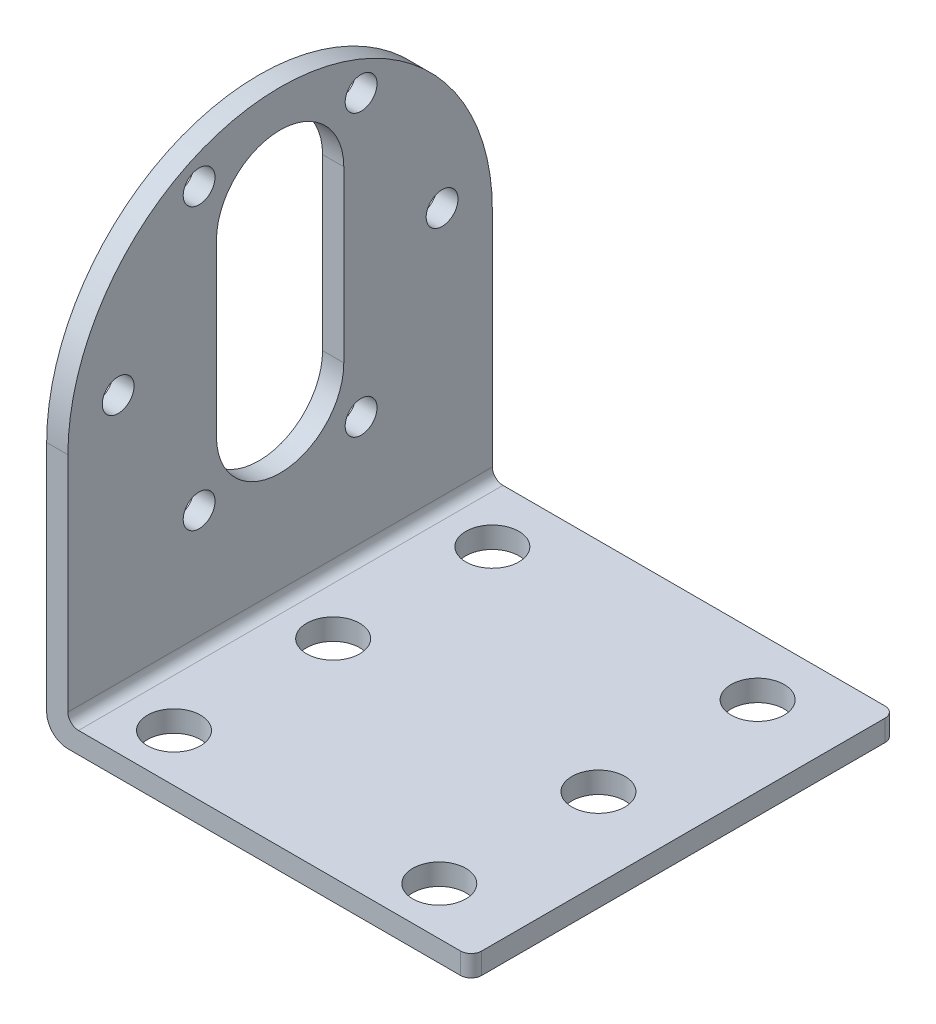
ISO-10303-21;
HEADER;
FILE_DESCRIPTION(('STEP AP214'),'2;1');
FILE_NAME('part.step','',(''),(''),'','','');
FILE_SCHEMA(('AUTOMOTIVE_DESIGN { 1 0 10303 214 1 1 1 1 }'));
ENDSEC;
DATA;
#1=APPLICATION_CONTEXT('core data for automotive mechanical design processes');
#2=APPLICATION_PROTOCOL_DEFINITION('international standard','automotive_design',2000,#1);
#3=PRODUCT_CONTEXT('',#1,'mechanical');
#4=PRODUCT('Part','Part','',(#3));
#5=PRODUCT_RELATED_PRODUCT_CATEGORY('part','',(#4));
#6=PRODUCT_DEFINITION_FORMATION('','',#4);
#7=PRODUCT_DEFINITION_CONTEXT('part definition',#1,'design');
#8=PRODUCT_DEFINITION('design','',#6,#7);
#9=PRODUCT_DEFINITION_SHAPE('','',#8);
#10=(LENGTH_UNIT() NAMED_UNIT(*) SI_UNIT(.MILLI.,.METRE.));
#11=(NAMED_UNIT(*) PLANE_ANGLE_UNIT() SI_UNIT($,.RADIAN.));
#12=(NAMED_UNIT(*) SI_UNIT($,.STERADIAN.) SOLID_ANGLE_UNIT());
#13=UNCERTAINTY_MEASURE_WITH_UNIT(LENGTH_MEASURE(1.E-05),#10,'distance_accuracy_value','');
#14=(GEOMETRIC_REPRESENTATION_CONTEXT(3) GLOBAL_UNCERTAINTY_ASSIGNED_CONTEXT((#13)) GLOBAL_UNIT_ASSIGNED_CONTEXT((#10,
#11,#12)) REPRESENTATION_CONTEXT('',''));
#15=CARTESIAN_POINT('',(0.,0.,0.));
#16=DIRECTION('',(0.,0.,1.));
#17=DIRECTION('',(1.,0.,0.));
#18=AXIS2_PLACEMENT_3D('',#15,#16,#17);
#19=CARTESIAN_POINT('',(2.,3.,40.));
#20=DIRECTION('',(-1.,0.,0.));
#21=DIRECTION('',(0.,0.,1.));
#22=AXIS2_PLACEMENT_3D('',#19,#20,#21);
#23=PLANE('',#22);
#24=CARTESIAN_POINT('',(2.,26.5,4.735));
#25=DIRECTION('',(1.,0.,0.));
#26=DIRECTION('',(0.,0.,-1.));
#27=AXIS2_PLACEMENT_3D('',#24,#25,#26);
#28=CIRCLE('',#27,1.5);
#29=CARTESIAN_POINT('',(2.,26.5,3.235));
#30=VERTEX_POINT('',#29);
#31=EDGE_CURVE('E274',#30,#30,#28,.T.);
#32=ORIENTED_EDGE('',*,*,#31,.F.);
#33=EDGE_LOOP('',(#32));
#34=FACE_BOUND('',#33,.T.);
#35=CARTESIAN_POINT('',(2.,39.7198777887694,12.3674999999999));
#36=DIRECTION('',(1.,0.,0.));
#37=DIRECTION('',(0.,0.,-1.));
#38=AXIS2_PLACEMENT_3D('',#35,#36,#37);
#39=CIRCLE('',#38,1.5);
#40=CARTESIAN_POINT('',(2.,39.7198777887694,10.8674999999999));
#41=VERTEX_POINT('',#40);
#42=EDGE_CURVE('E305',#41,#41,#39,.T.);
#43=ORIENTED_EDGE('',*,*,#42,.F.);
#44=EDGE_LOOP('',(#43));
#45=FACE_BOUND('',#44,.T.);
#46=CARTESIAN_POINT('',(2.,26.5,35.265));
#47=DIRECTION('',(1.,0.,0.));
#48=DIRECTION('',(0.,0.,-1.));
#49=AXIS2_PLACEMENT_3D('',#46,#47,#48);
#50=CIRCLE('',#49,1.5);
#51=CARTESIAN_POINT('',(2.,26.5,33.765));
#52=VERTEX_POINT('',#51);
#53=EDGE_CURVE('E316',#52,#52,#50,.T.);
#54=ORIENTED_EDGE('',*,*,#53,.F.);
#55=EDGE_LOOP('',(#54));
#56=FACE_BOUND('',#55,.T.);
#57=CARTESIAN_POINT('',(2.,13.2801222112306,27.6325000000001));
#58=DIRECTION('',(1.,0.,0.));
#59=DIRECTION('',(0.,0.,-1.));
#60=AXIS2_PLACEMENT_3D('',#57,#58,#59);
#61=CIRCLE('',#60,1.5);
#62=CARTESIAN_POINT('',(2.,13.2801222112306,26.1325000000001));
#63=VERTEX_POINT('',#62);
#64=EDGE_CURVE('E323',#63,#63,#61,.T.);
#65=ORIENTED_EDGE('',*,*,#64,.F.);
#66=EDGE_LOOP('',(#65));
#67=FACE_BOUND('',#66,.T.);
#68=CARTESIAN_POINT('',(2.,13.2801222112306,12.3674999999999));
#69=DIRECTION('',(1.,0.,0.));
#70=DIRECTION('',(0.,0.,-1.));
#71=AXIS2_PLACEMENT_3D('',#68,#69,#70);
#72=CIRCLE('',#71,1.5);
#73=CARTESIAN_POINT('',(2.,13.2801222112306,10.8674999999999));
#74=VERTEX_POINT('',#73);
#75=EDGE_CURVE('E320',#74,#74,#72,.T.);
#76=ORIENTED_EDGE('',*,*,#75,.F.);
#77=EDGE_LOOP('',(#76));
#78=FACE_BOUND('',#77,.T.);
#79=CARTESIAN_POINT('',(2.,39.7198777887694,27.6325000000001));
#80=DIRECTION('',(1.,0.,0.));
#81=DIRECTION('',(0.,0.,-1.));
#82=AXIS2_PLACEMENT_3D('',#79,#80,#81);
#83=CIRCLE('',#82,1.5);
#84=CARTESIAN_POINT('',(2.,39.7198777887694,26.1325000000001));
#85=VERTEX_POINT('',#84);
#86=EDGE_CURVE('E319',#85,#85,#83,.T.);
#87=ORIENTED_EDGE('',*,*,#86,.F.);
#88=EDGE_LOOP('',(#87));
#89=FACE_BOUND('',#88,.T.);
#90=DIRECTION('',(0.,-1.,0.));
#91=VECTOR('',#90,1.);
#92=CARTESIAN_POINT('',(2.,34.5,26.));
#93=LINE('',#92,#91);
#94=CARTESIAN_POINT('',(2.,34.5,26.));
#95=VERTEX_POINT('',#94);
#96=CARTESIAN_POINT('',(2.,18.5,26.));
#97=VERTEX_POINT('',#96);
#98=EDGE_CURVE('E165',#95,#97,#93,.T.);
#99=ORIENTED_EDGE('',*,*,#98,.F.);
#100=CARTESIAN_POINT('',(2.,34.5,20.));
#101=DIRECTION('',(1.,0.,0.));
#102=DIRECTION('',(0.,0.,-1.));
#103=AXIS2_PLACEMENT_3D('',#100,#101,#102);
#104=CIRCLE('',#103,5.99999999999999);
#105=CARTESIAN_POINT('',(2.,34.5,14.));
#106=VERTEX_POINT('',#105);
#107=EDGE_CURVE('E170',#106,#95,#104,.T.);
#108=ORIENTED_EDGE('',*,*,#107,.F.);
#109=DIRECTION('',(0.,1.,0.));
#110=VECTOR('',#109,1.);
#111=CARTESIAN_POINT('',(2.,34.5,14.));
#112=LINE('',#111,#110);
#113=CARTESIAN_POINT('',(2.,18.5,14.));
#114=VERTEX_POINT('',#113);
#115=EDGE_CURVE('E174',#114,#106,#112,.T.);
#116=ORIENTED_EDGE('',*,*,#115,.F.);
#117=CARTESIAN_POINT('',(2.,18.5,20.));
#118=DIRECTION('',(1.,0.,0.));
#119=DIRECTION('',(0.,0.,-1.));
#120=AXIS2_PLACEMENT_3D('',#117,#118,#119);
#121=CIRCLE('',#120,5.99999999999999);
#122=EDGE_CURVE('E154',#97,#114,#121,.T.);
#123=ORIENTED_EDGE('',*,*,#122,.F.);
#124=EDGE_LOOP('',(#99,#108,#116,#123));
#125=FACE_BOUND('',#124,.T.);
#126=DIRECTION('',(0.,1.,0.));
#127=VECTOR('',#126,1.);
#128=CARTESIAN_POINT('',(2.,3.,0.));
#129=LINE('',#128,#127);
#130=CARTESIAN_POINT('',(2.,3.,0.));
#131=VERTEX_POINT('',#130);
#132=CARTESIAN_POINT('',(2.,24.,0.));
#133=VERTEX_POINT('',#132);
#134=EDGE_CURVE('E233',#131,#133,#129,.T.);
#135=ORIENTED_EDGE('',*,*,#134,.T.);
#136=CARTESIAN_POINT('',(2.,24.,20.));
#137=DIRECTION('',(1.,0.,0.));
#138=DIRECTION('',(0.,0.,-1.));
#139=AXIS2_PLACEMENT_3D('',#136,#137,#138);
#140=CIRCLE('',#139,20.);
#141=CARTESIAN_POINT('',(2.,24.,40.));
#142=VERTEX_POINT('',#141);
#143=EDGE_CURVE('E181',#142,#133,#140,.F.);
#144=ORIENTED_EDGE('',*,*,#143,.F.);
#145=DIRECTION('',(0.,1.,0.));
#146=VECTOR('',#145,1.);
#147=CARTESIAN_POINT('',(2.,3.,40.));
#148=LINE('',#147,#146);
#149=CARTESIAN_POINT('',(2.,3.,40.));
#150=VERTEX_POINT('',#149);
#151=EDGE_CURVE('E220',#150,#142,#148,.T.);
#152=ORIENTED_EDGE('',*,*,#151,.F.);
#153=DIRECTION('',(0.,0.,-1.));
#154=VECTOR('',#153,1.);
#155=CARTESIAN_POINT('',(2.,3.,40.));
#156=LINE('',#155,#154);
#157=EDGE_CURVE('E249',#150,#131,#156,.T.);
#158=ORIENTED_EDGE('',*,*,#157,.T.);
#159=EDGE_LOOP('',(#135,#144,#152,#158));
#160=FACE_BOUND('',#159,.T.);
#161=ADVANCED_FACE('F42',(#34,#45,#56,#67,#78,#89,#125,#160),#23,.F.);
#162=CARTESIAN_POINT('',(0.,2.00000000000001,40.));
#163=DIRECTION('',(1.,0.,0.));
#164=DIRECTION('',(0.,0.,-1.));
#165=AXIS2_PLACEMENT_3D('',#162,#163,#164);
#166=PLANE('',#165);
#167=CARTESIAN_POINT('',(0.,26.5,4.735));
#168=DIRECTION('',(1.,0.,0.));
#169=DIRECTION('',(0.,0.,-1.));
#170=AXIS2_PLACEMENT_3D('',#167,#168,#169);
#171=CIRCLE('',#170,1.5);
#172=CARTESIAN_POINT('',(0.,26.5,3.235));
#173=VERTEX_POINT('',#172);
#174=EDGE_CURVE('E286',#173,#173,#171,.T.);
#175=ORIENTED_EDGE('',*,*,#174,.T.);
#176=EDGE_LOOP('',(#175));
#177=FACE_BOUND('',#176,.T.);
#178=CARTESIAN_POINT('',(0.,39.7198777887694,12.3674999999999));
#179=DIRECTION('',(1.,0.,0.));
#180=DIRECTION('',(0.,0.,-1.));
#181=AXIS2_PLACEMENT_3D('',#178,#179,#180);
#182=CIRCLE('',#181,1.5);
#183=CARTESIAN_POINT('',(0.,39.7198777887694,10.8674999999999));
#184=VERTEX_POINT('',#183);
#185=EDGE_CURVE('E283',#184,#184,#182,.T.);
#186=ORIENTED_EDGE('',*,*,#185,.T.);
#187=EDGE_LOOP('',(#186));
#188=FACE_BOUND('',#187,.T.);
#189=CARTESIAN_POINT('',(0.,26.5,35.265));
#190=DIRECTION('',(1.,0.,0.));
#191=DIRECTION('',(0.,0.,-1.));
#192=AXIS2_PLACEMENT_3D('',#189,#190,#191);
#193=CIRCLE('',#192,1.5);
#194=CARTESIAN_POINT('',(0.,26.5,33.765));
#195=VERTEX_POINT('',#194);
#196=EDGE_CURVE('E280',#195,#195,#193,.T.);
#197=ORIENTED_EDGE('',*,*,#196,.T.);
#198=EDGE_LOOP('',(#197));
#199=FACE_BOUND('',#198,.T.);
#200=CARTESIAN_POINT('',(0.,13.2801222112306,27.6325000000001));
#201=DIRECTION('',(1.,0.,0.));
#202=DIRECTION('',(0.,0.,-1.));
#203=AXIS2_PLACEMENT_3D('',#200,#201,#202);
#204=CIRCLE('',#203,1.5);
#205=CARTESIAN_POINT('',(0.,13.2801222112306,26.1325000000001));
#206=VERTEX_POINT('',#205);
#207=EDGE_CURVE('E277',#206,#206,#204,.T.);
#208=ORIENTED_EDGE('',*,*,#207,.T.);
#209=EDGE_LOOP('',(#208));
#210=FACE_BOUND('',#209,.T.);
#211=CARTESIAN_POINT('',(0.,13.2801222112306,12.3674999999999));
#212=DIRECTION('',(1.,0.,0.));
#213=DIRECTION('',(0.,0.,-1.));
#214=AXIS2_PLACEMENT_3D('',#211,#212,#213);
#215=CIRCLE('',#214,1.5);
#216=CARTESIAN_POINT('',(0.,13.2801222112306,10.8674999999999));
#217=VERTEX_POINT('',#216);
#218=EDGE_CURVE('E273',#217,#217,#215,.T.);
#219=ORIENTED_EDGE('',*,*,#218,.T.);
#220=EDGE_LOOP('',(#219));
#221=FACE_BOUND('',#220,.T.);
#222=CARTESIAN_POINT('',(0.,39.7198777887694,27.6325000000001));
#223=DIRECTION('',(1.,0.,0.));
#224=DIRECTION('',(0.,0.,-1.));
#225=AXIS2_PLACEMENT_3D('',#222,#223,#224);
#226=CIRCLE('',#225,1.5);
#227=CARTESIAN_POINT('',(0.,39.7198777887694,26.1325000000001));
#228=VERTEX_POINT('',#227);
#229=EDGE_CURVE('E270',#228,#228,#226,.T.);
#230=ORIENTED_EDGE('',*,*,#229,.T.);
#231=EDGE_LOOP('',(#230));
#232=FACE_BOUND('',#231,.T.);
#233=DIRECTION('',(0.,1.,0.));
#234=VECTOR('',#233,1.);
#235=CARTESIAN_POINT('',(0.,2.00000000000002,14.));
#236=LINE('',#235,#234);
#237=CARTESIAN_POINT('',(0.,18.5,14.));
#238=VERTEX_POINT('',#237);
#239=CARTESIAN_POINT('',(0.,34.5,14.));
#240=VERTEX_POINT('',#239);
#241=EDGE_CURVE('E263',#238,#240,#236,.T.);
#242=ORIENTED_EDGE('',*,*,#241,.T.);
#243=CARTESIAN_POINT('',(0.,34.5,20.));
#244=DIRECTION('',(1.,0.,0.));
#245=DIRECTION('',(0.,0.,-1.));
#246=AXIS2_PLACEMENT_3D('',#243,#244,#245);
#247=CIRCLE('',#246,5.99999999999999);
#248=CARTESIAN_POINT('',(0.,34.5,26.));
#249=VERTEX_POINT('',#248);
#250=EDGE_CURVE('E266',#240,#249,#247,.T.);
#251=ORIENTED_EDGE('',*,*,#250,.T.);
#252=DIRECTION('',(0.,-1.,0.));
#253=VECTOR('',#252,1.);
#254=CARTESIAN_POINT('',(0.,2.00000000000002,26.));
#255=LINE('',#254,#253);
#256=CARTESIAN_POINT('',(0.,18.5,26.));
#257=VERTEX_POINT('',#256);
#258=EDGE_CURVE('E260',#249,#257,#255,.T.);
#259=ORIENTED_EDGE('',*,*,#258,.T.);
#260=CARTESIAN_POINT('',(0.,18.5,20.));
#261=DIRECTION('',(1.,0.,0.));
#262=DIRECTION('',(0.,0.,-1.));
#263=AXIS2_PLACEMENT_3D('',#260,#261,#262);
#264=CIRCLE('',#263,5.99999999999999);
#265=EDGE_CURVE('E157',#257,#238,#264,.T.);
#266=ORIENTED_EDGE('',*,*,#265,.T.);
#267=EDGE_LOOP('',(#242,#251,#259,#266));
#268=FACE_BOUND('',#267,.T.);
#269=DIRECTION('',(0.,-1.,0.));
#270=VECTOR('',#269,1.);
#271=CARTESIAN_POINT('',(0.,2.00000000000001,40.));
#272=LINE('',#271,#270);
#273=CARTESIAN_POINT('',(0.,24.,40.));
#274=VERTEX_POINT('',#273);
#275=CARTESIAN_POINT('',(0.,2.,40.));
#276=VERTEX_POINT('',#275);
#277=EDGE_CURVE('E223',#274,#276,#272,.T.);
#278=ORIENTED_EDGE('',*,*,#277,.F.);
#279=CARTESIAN_POINT('',(0.,24.,20.));
#280=DIRECTION('',(1.,0.,0.));
#281=DIRECTION('',(0.,0.,-1.));
#282=AXIS2_PLACEMENT_3D('',#279,#280,#281);
#283=CIRCLE('',#282,20.);
#284=CARTESIAN_POINT('',(0.,24.,0.));
#285=VERTEX_POINT('',#284);
#286=EDGE_CURVE('E187',#274,#285,#283,.F.);
#287=ORIENTED_EDGE('',*,*,#286,.T.);
#288=DIRECTION('',(0.,-1.,0.));
#289=VECTOR('',#288,1.);
#290=CARTESIAN_POINT('',(0.,2.00000000000001,0.));
#291=LINE('',#290,#289);
#292=CARTESIAN_POINT('',(0.,2.,0.));
#293=VERTEX_POINT('',#292);
#294=EDGE_CURVE('E236',#285,#293,#291,.T.);
#295=ORIENTED_EDGE('',*,*,#294,.T.);
#296=DIRECTION('',(0.,0.,-1.));
#297=VECTOR('',#296,1.);
#298=CARTESIAN_POINT('',(0.,2.,40.));
#299=LINE('',#298,#297);
#300=EDGE_CURVE('E246',#276,#293,#299,.T.);
#301=ORIENTED_EDGE('',*,*,#300,.F.);
#302=EDGE_LOOP('',(#278,#287,#295,#301));
#303=FACE_BOUND('',#302,.T.);
#304=ADVANCED_FACE('F335',(#177,#188,#199,#210,#221,#232,#268,#303),#166,.F.);
#305=CARTESIAN_POINT('',(3.,2.,40.));
#306=DIRECTION('',(0.,-1.,0.));
#307=DIRECTION('',(0.,0.,-1.));
#308=AXIS2_PLACEMENT_3D('',#305,#306,#307);
#309=PLANE('',#308);
#310=CARTESIAN_POINT('',(7.5,2.,20.5));
#311=DIRECTION('',(0.,1.,0.));
#312=DIRECTION('',(0.,0.,1.));
#313=AXIS2_PLACEMENT_3D('',#310,#311,#312);
#314=CIRCLE('',#313,2.5);
#315=CARTESIAN_POINT('',(7.5,2.,23.));
#316=VERTEX_POINT('',#315);
#317=EDGE_CURVE('E301',#316,#316,#314,.T.);
#318=ORIENTED_EDGE('',*,*,#317,.F.);
#319=EDGE_LOOP('',(#318));
#320=FACE_BOUND('',#319,.T.);
#321=CARTESIAN_POINT('',(32.5,2.,20.5));
#322=DIRECTION('',(0.,1.,0.));
#323=DIRECTION('',(0.,0.,1.));
#324=AXIS2_PLACEMENT_3D('',#321,#322,#323);
#325=CIRCLE('',#324,2.5);
#326=CARTESIAN_POINT('',(32.5,2.,23.));
#327=VERTEX_POINT('',#326);
#328=EDGE_CURVE('E307',#327,#327,#325,.T.);
#329=ORIENTED_EDGE('',*,*,#328,.F.);
#330=EDGE_LOOP('',(#329));
#331=FACE_BOUND('',#330,.T.);
#332=CARTESIAN_POINT('',(32.5,2.,35.5));
#333=DIRECTION('',(0.,1.,0.));
#334=DIRECTION('',(0.,0.,1.));
#335=AXIS2_PLACEMENT_3D('',#332,#333,#334);
#336=CIRCLE('',#335,2.50000000000002);
#337=CARTESIAN_POINT('',(32.5,2.,38.));
#338=VERTEX_POINT('',#337);
#339=EDGE_CURVE('E190',#338,#338,#336,.T.);
#340=ORIENTED_EDGE('',*,*,#339,.F.);
#341=EDGE_LOOP('',(#340));
#342=FACE_BOUND('',#341,.T.);
#343=CARTESIAN_POINT('',(32.5,2.,5.5));
#344=DIRECTION('',(0.,1.,0.));
#345=DIRECTION('',(0.,0.,1.));
#346=AXIS2_PLACEMENT_3D('',#343,#344,#345);
#347=CIRCLE('',#346,2.50000000000002);
#348=CARTESIAN_POINT('',(32.5,2.,8.00000000000002));
#349=VERTEX_POINT('',#348);
#350=EDGE_CURVE('E196',#349,#349,#347,.T.);
#351=ORIENTED_EDGE('',*,*,#350,.F.);
#352=EDGE_LOOP('',(#351));
#353=FACE_BOUND('',#352,.T.);
#354=CARTESIAN_POINT('',(7.5,2.,5.5));
#355=DIRECTION('',(0.,1.,0.));
#356=DIRECTION('',(0.,0.,1.));
#357=AXIS2_PLACEMENT_3D('',#354,#355,#356);
#358=CIRCLE('',#357,2.50000000000001);
#359=CARTESIAN_POINT('',(7.5,2.,8.00000000000002));
#360=VERTEX_POINT('',#359);
#361=EDGE_CURVE('E202',#360,#360,#358,.T.);
#362=ORIENTED_EDGE('',*,*,#361,.F.);
#363=EDGE_LOOP('',(#362));
#364=FACE_BOUND('',#363,.T.);
#365=DIRECTION('',(0.,0.,-1.));
#366=VECTOR('',#365,1.);
#367=CARTESIAN_POINT('',(40.,2.,40.));
#368=LINE('',#367,#366);
#369=CARTESIAN_POINT('',(40.,2.,39.));
#370=VERTEX_POINT('',#369);
#371=CARTESIAN_POINT('',(40.,2.,1.));
#372=VERTEX_POINT('',#371);
#373=EDGE_CURVE('E255',#370,#372,#368,.T.);
#374=ORIENTED_EDGE('',*,*,#373,.T.);
#375=CARTESIAN_POINT('',(39.,2.,1.));
#376=DIRECTION('',(0.,-1.,0.));
#377=DIRECTION('',(0.,0.,-1.));
#378=AXIS2_PLACEMENT_3D('',#375,#376,#377);
#379=CIRCLE('',#378,1.);
#380=CARTESIAN_POINT('',(39.,2.,0.));
#381=VERTEX_POINT('',#380);
#382=EDGE_CURVE('E295',#372,#381,#379,.F.);
#383=ORIENTED_EDGE('',*,*,#382,.T.);
#384=DIRECTION('',(-1.,0.,0.));
#385=VECTOR('',#384,1.);
#386=CARTESIAN_POINT('',(3.,2.,0.));
#387=LINE('',#386,#385);
#388=CARTESIAN_POINT('',(3.,2.,0.));
#389=VERTEX_POINT('',#388);
#390=EDGE_CURVE('E214',#381,#389,#387,.T.);
#391=ORIENTED_EDGE('',*,*,#390,.T.);
#392=DIRECTION('',(0.,0.,-1.));
#393=VECTOR('',#392,1.);
#394=CARTESIAN_POINT('',(3.,2.,40.));
#395=LINE('',#394,#393);
#396=CARTESIAN_POINT('',(3.,2.,40.));
#397=VERTEX_POINT('',#396);
#398=EDGE_CURVE('E252',#397,#389,#395,.T.);
#399=ORIENTED_EDGE('',*,*,#398,.F.);
#400=DIRECTION('',(-1.,0.,0.));
#401=VECTOR('',#400,1.);
#402=CARTESIAN_POINT('',(3.,2.,40.));
#403=LINE('',#402,#401);
#404=CARTESIAN_POINT('',(39.,2.,40.));
#405=VERTEX_POINT('',#404);
#406=EDGE_CURVE('E215',#405,#397,#403,.T.);
#407=ORIENTED_EDGE('',*,*,#406,.F.);
#408=CARTESIAN_POINT('',(39.,2.,39.));
#409=DIRECTION('',(0.,-1.,0.));
#410=DIRECTION('',(0.,0.,-1.));
#411=AXIS2_PLACEMENT_3D('',#408,#409,#410);
#412=CIRCLE('',#411,1.);
#413=EDGE_CURVE('E293',#405,#370,#412,.F.);
#414=ORIENTED_EDGE('',*,*,#413,.T.);
#415=EDGE_LOOP('',(#374,#383,#391,#399,#407,#414));
#416=FACE_BOUND('',#415,.T.);
#417=CARTESIAN_POINT('',(7.5,2.,35.5));
#418=DIRECTION('',(0.,1.,0.));
#419=DIRECTION('',(0.,0.,1.));
#420=AXIS2_PLACEMENT_3D('',#417,#418,#419);
#421=CIRCLE('',#420,2.50000000000001);
#422=CARTESIAN_POINT('',(7.5,2.,38.));
#423=VERTEX_POINT('',#422);
#424=EDGE_CURVE('E208',#423,#423,#421,.T.);
#425=ORIENTED_EDGE('',*,*,#424,.F.);
#426=EDGE_LOOP('',(#425));
#427=FACE_BOUND('',#426,.T.);
#428=ADVANCED_FACE('F338',(#320,#331,#342,#353,#364,#416,#427),#309,.F.);
#429=CARTESIAN_POINT('',(40.,2.,40.));
#430=DIRECTION('',(-1.,0.,0.));
#431=DIRECTION('',(0.,0.,1.));
#432=AXIS2_PLACEMENT_3D('',#429,#430,#431);
#433=PLANE('',#432);
#434=DIRECTION('',(0.,0.,-1.));
#435=VECTOR('',#434,1.);
#436=CARTESIAN_POINT('',(40.,0.,40.));
#437=LINE('',#436,#435);
#438=CARTESIAN_POINT('',(40.,0.,39.));
#439=VERTEX_POINT('',#438);
#440=CARTESIAN_POINT('',(40.,0.,1.));
#441=VERTEX_POINT('',#440);
#442=EDGE_CURVE('E229',#439,#441,#437,.T.);
#443=ORIENTED_EDGE('',*,*,#442,.T.);
#444=DIRECTION('',(0.,1.,0.));
#445=VECTOR('',#444,1.);
#446=CARTESIAN_POINT('',(40.,2.,1.));
#447=LINE('',#446,#445);
#448=EDGE_CURVE('E290',#441,#372,#447,.T.);
#449=ORIENTED_EDGE('',*,*,#448,.T.);
#450=ORIENTED_EDGE('',*,*,#373,.F.);
#451=DIRECTION('',(0.,1.,0.));
#452=VECTOR('',#451,1.);
#453=CARTESIAN_POINT('',(40.,2.,39.));
#454=LINE('',#453,#452);
#455=EDGE_CURVE('E269',#370,#439,#454,.F.);
#456=ORIENTED_EDGE('',*,*,#455,.T.);
#457=EDGE_LOOP('',(#443,#449,#450,#456));
#458=FACE_BOUND('',#457,.T.);
#459=ADVANCED_FACE('F371',(#458),#433,.F.);
#460=CARTESIAN_POINT('',(3.,3.,40.));
#461=DIRECTION('',(0.,0.,-1.));
#462=DIRECTION('',(-1.,0.,0.));
#463=AXIS2_PLACEMENT_3D('',#460,#461,#462);
#464=CYLINDRICAL_SURFACE('',#463,1.);
#465=CARTESIAN_POINT('',(3.,3.,0.));
#466=DIRECTION('',(0.,0.,-1.));
#467=DIRECTION('',(-1.,0.,0.));
#468=AXIS2_PLACEMENT_3D('',#465,#466,#467);
#469=CIRCLE('',#468,1.);
#470=EDGE_CURVE('E231',#389,#131,#469,.T.);
#471=ORIENTED_EDGE('',*,*,#470,.T.);
#472=ORIENTED_EDGE('',*,*,#157,.F.);
#473=CARTESIAN_POINT('',(3.,3.,40.));
#474=DIRECTION('',(0.,0.,-1.));
#475=DIRECTION('',(-1.,0.,0.));
#476=AXIS2_PLACEMENT_3D('',#473,#474,#475);
#477=CIRCLE('',#476,1.);
#478=EDGE_CURVE('E217',#397,#150,#477,.T.);
#479=ORIENTED_EDGE('',*,*,#478,.F.);
#480=ORIENTED_EDGE('',*,*,#398,.T.);
#481=EDGE_LOOP('',(#471,#472,#479,#480));
#482=FACE_BOUND('',#481,.T.);
#483=ADVANCED_FACE('F378',(#482),#464,.F.);
#484=CARTESIAN_POINT('',(2.,2.,40.));
#485=DIRECTION('',(0.,0.,-1.));
#486=DIRECTION('',(-1.,0.,0.));
#487=AXIS2_PLACEMENT_3D('',#484,#485,#486);
#488=CYLINDRICAL_SURFACE('',#487,2.);
#489=CARTESIAN_POINT('',(2.,2.,0.));
#490=DIRECTION('',(0.,0.,1.));
#491=DIRECTION('',(-1.,0.,0.));
#492=AXIS2_PLACEMENT_3D('',#489,#490,#491);
#493=CIRCLE('',#492,2.);
#494=CARTESIAN_POINT('',(2.00000000000001,0.,0.));
#495=VERTEX_POINT('',#494);
#496=EDGE_CURVE('E238',#293,#495,#493,.T.);
#497=ORIENTED_EDGE('',*,*,#496,.T.);
#498=DIRECTION('',(0.,0.,-1.));
#499=VECTOR('',#498,1.);
#500=CARTESIAN_POINT('',(2.00000000000001,0.,40.));
#501=LINE('',#500,#499);
#502=CARTESIAN_POINT('',(2.00000000000001,0.,40.));
#503=VERTEX_POINT('',#502);
#504=EDGE_CURVE('E243',#503,#495,#501,.T.);
#505=ORIENTED_EDGE('',*,*,#504,.F.);
#506=CARTESIAN_POINT('',(2.,2.,40.));
#507=DIRECTION('',(0.,0.,1.));
#508=DIRECTION('',(-1.,0.,0.));
#509=AXIS2_PLACEMENT_3D('',#506,#507,#508);
#510=CIRCLE('',#509,2.);
#511=EDGE_CURVE('E225',#276,#503,#510,.T.);
#512=ORIENTED_EDGE('',*,*,#511,.F.);
#513=ORIENTED_EDGE('',*,*,#300,.T.);
#514=EDGE_LOOP('',(#497,#505,#512,#513));
#515=FACE_BOUND('',#514,.T.);
#516=ADVANCED_FACE('F360',(#515),#488,.T.);
#517=CARTESIAN_POINT('',(2.00000000000001,0.,40.));
#518=DIRECTION('',(0.,1.,0.));
#519=DIRECTION('',(0.,0.,1.));
#520=AXIS2_PLACEMENT_3D('',#517,#518,#519);
#521=PLANE('',#520);
#522=CARTESIAN_POINT('',(7.5,0.,20.5));
#523=DIRECTION('',(0.,1.,0.));
#524=DIRECTION('',(0.,0.,1.));
#525=AXIS2_PLACEMENT_3D('',#522,#523,#524);
#526=CIRCLE('',#525,2.5);
#527=CARTESIAN_POINT('',(7.5,0.,23.));
#528=VERTEX_POINT('',#527);
#529=EDGE_CURVE('E46',#528,#528,#526,.T.);
#530=ORIENTED_EDGE('',*,*,#529,.T.);
#531=EDGE_LOOP('',(#530));
#532=FACE_BOUND('',#531,.T.);
#533=CARTESIAN_POINT('',(32.5,0.,20.5));
#534=DIRECTION('',(0.,1.,0.));
#535=DIRECTION('',(0.,0.,1.));
#536=AXIS2_PLACEMENT_3D('',#533,#534,#535);
#537=CIRCLE('',#536,2.5);
#538=CARTESIAN_POINT('',(32.5,0.,23.));
#539=VERTEX_POINT('',#538);
#540=EDGE_CURVE('E299',#539,#539,#537,.T.);
#541=ORIENTED_EDGE('',*,*,#540,.T.);
#542=EDGE_LOOP('',(#541));
#543=FACE_BOUND('',#542,.T.);
#544=CARTESIAN_POINT('',(32.5,0.,35.5));
#545=DIRECTION('',(0.,1.,0.));
#546=DIRECTION('',(0.,0.,1.));
#547=AXIS2_PLACEMENT_3D('',#544,#545,#546);
#548=CIRCLE('',#547,2.50000000000002);
#549=CARTESIAN_POINT('',(32.5,0.,38.));
#550=VERTEX_POINT('',#549);
#551=EDGE_CURVE('E193',#550,#550,#548,.T.);
#552=ORIENTED_EDGE('',*,*,#551,.T.);
#553=EDGE_LOOP('',(#552));
#554=FACE_BOUND('',#553,.T.);
#555=CARTESIAN_POINT('',(32.5,0.,5.5));
#556=DIRECTION('',(0.,1.,0.));
#557=DIRECTION('',(0.,0.,1.));
#558=AXIS2_PLACEMENT_3D('',#555,#556,#557);
#559=CIRCLE('',#558,2.50000000000002);
#560=CARTESIAN_POINT('',(32.5,0.,8.00000000000002));
#561=VERTEX_POINT('',#560);
#562=EDGE_CURVE('E199',#561,#561,#559,.T.);
#563=ORIENTED_EDGE('',*,*,#562,.T.);
#564=EDGE_LOOP('',(#563));
#565=FACE_BOUND('',#564,.T.);
#566=CARTESIAN_POINT('',(7.5,0.,5.5));
#567=DIRECTION('',(0.,1.,0.));
#568=DIRECTION('',(0.,0.,1.));
#569=AXIS2_PLACEMENT_3D('',#566,#567,#568);
#570=CIRCLE('',#569,2.50000000000001);
#571=CARTESIAN_POINT('',(7.5,0.,8.00000000000002));
#572=VERTEX_POINT('',#571);
#573=EDGE_CURVE('E205',#572,#572,#570,.T.);
#574=ORIENTED_EDGE('',*,*,#573,.T.);
#575=EDGE_LOOP('',(#574));
#576=FACE_BOUND('',#575,.T.);
#577=CARTESIAN_POINT('',(7.5,0.,35.5));
#578=DIRECTION('',(0.,1.,0.));
#579=DIRECTION('',(0.,0.,1.));
#580=AXIS2_PLACEMENT_3D('',#577,#578,#579);
#581=CIRCLE('',#580,2.50000000000001);
#582=CARTESIAN_POINT('',(7.5,0.,38.));
#583=VERTEX_POINT('',#582);
#584=EDGE_CURVE('E211',#583,#583,#581,.T.);
#585=ORIENTED_EDGE('',*,*,#584,.T.);
#586=EDGE_LOOP('',(#585));
#587=FACE_BOUND('',#586,.T.);
#588=DIRECTION('',(1.,0.,0.));
#589=VECTOR('',#588,1.);
#590=CARTESIAN_POINT('',(2.00000000000001,0.,0.));
#591=LINE('',#590,#589);
#592=CARTESIAN_POINT('',(39.,0.,0.));
#593=VERTEX_POINT('',#592);
#594=EDGE_CURVE('E218',#495,#593,#591,.T.);
#595=ORIENTED_EDGE('',*,*,#594,.T.);
#596=CARTESIAN_POINT('',(39.,0.,1.));
#597=DIRECTION('',(0.,1.,0.));
#598=DIRECTION('',(0.,0.,1.));
#599=AXIS2_PLACEMENT_3D('',#596,#597,#598);
#600=CIRCLE('',#599,1.);
#601=EDGE_CURVE('E51',#593,#441,#600,.F.);
#602=ORIENTED_EDGE('',*,*,#601,.T.);
#603=ORIENTED_EDGE('',*,*,#442,.F.);
#604=CARTESIAN_POINT('',(39.,0.,39.));
#605=DIRECTION('',(0.,1.,0.));
#606=DIRECTION('',(0.,0.,1.));
#607=AXIS2_PLACEMENT_3D('',#604,#605,#606);
#608=CIRCLE('',#607,1.);
#609=CARTESIAN_POINT('',(39.,0.,40.));
#610=VERTEX_POINT('',#609);
#611=EDGE_CURVE('E59',#439,#610,#608,.F.);
#612=ORIENTED_EDGE('',*,*,#611,.T.);
#613=DIRECTION('',(1.,0.,0.));
#614=VECTOR('',#613,1.);
#615=CARTESIAN_POINT('',(2.00000000000001,0.,40.));
#616=LINE('',#615,#614);
#617=EDGE_CURVE('E227',#503,#610,#616,.T.);
#618=ORIENTED_EDGE('',*,*,#617,.F.);
#619=ORIENTED_EDGE('',*,*,#504,.T.);
#620=EDGE_LOOP('',(#595,#602,#603,#612,#618,#619));
#621=FACE_BOUND('',#620,.T.);
#622=ADVANCED_FACE('F361',(#532,#543,#554,#565,#576,#587,#621),#521,.F.);
#623=CARTESIAN_POINT('',(2.,2.,40.));
#624=DIRECTION('',(0.,0.,-1.));
#625=DIRECTION('',(-1.,0.,0.));
#626=AXIS2_PLACEMENT_3D('',#623,#624,#625);
#627=PLANE('',#626);
#628=ORIENTED_EDGE('',*,*,#617,.T.);
#629=DIRECTION('',(0.,1.,0.));
#630=VECTOR('',#629,1.);
#631=CARTESIAN_POINT('',(39.,2.,40.));
#632=LINE('',#631,#630);
#633=EDGE_CURVE('E12',#610,#405,#632,.T.);
#634=ORIENTED_EDGE('',*,*,#633,.T.);
#635=ORIENTED_EDGE('',*,*,#406,.T.);
#636=ORIENTED_EDGE('',*,*,#478,.T.);
#637=ORIENTED_EDGE('',*,*,#151,.T.);
#638=DIRECTION('',(1.,0.,0.));
#639=VECTOR('',#638,1.);
#640=CARTESIAN_POINT('',(-38.,24.,40.));
#641=LINE('',#640,#639);
#642=EDGE_CURVE('E185',#274,#142,#641,.T.);
#643=ORIENTED_EDGE('',*,*,#642,.F.);
#644=ORIENTED_EDGE('',*,*,#277,.T.);
#645=ORIENTED_EDGE('',*,*,#511,.T.);
#646=EDGE_LOOP('',(#628,#634,#635,#636,#637,#643,#644,#645));
#647=FACE_BOUND('',#646,.T.);
#648=ADVANCED_FACE('F347',(#647),#627,.F.);
#649=CARTESIAN_POINT('',(2.,2.,0.));
#650=DIRECTION('',(0.,0.,-1.));
#651=DIRECTION('',(-1.,0.,0.));
#652=AXIS2_PLACEMENT_3D('',#649,#650,#651);
#653=PLANE('',#652);
#654=ORIENTED_EDGE('',*,*,#390,.F.);
#655=DIRECTION('',(0.,1.,0.));
#656=VECTOR('',#655,1.);
#657=CARTESIAN_POINT('',(39.,0.,0.));
#658=LINE('',#657,#656);
#659=EDGE_CURVE('E67',#381,#593,#658,.F.);
#660=ORIENTED_EDGE('',*,*,#659,.T.);
#661=ORIENTED_EDGE('',*,*,#594,.F.);
#662=ORIENTED_EDGE('',*,*,#496,.F.);
#663=ORIENTED_EDGE('',*,*,#294,.F.);
#664=DIRECTION('',(1.,0.,0.));
#665=VECTOR('',#664,1.);
#666=CARTESIAN_POINT('',(-38.,24.,0.));
#667=LINE('',#666,#665);
#668=EDGE_CURVE('E258',#133,#285,#667,.F.);
#669=ORIENTED_EDGE('',*,*,#668,.F.);
#670=ORIENTED_EDGE('',*,*,#134,.F.);
#671=ORIENTED_EDGE('',*,*,#470,.F.);
#672=EDGE_LOOP('',(#654,#660,#661,#662,#663,#669,#670,#671));
#673=FACE_BOUND('',#672,.T.);
#674=ADVANCED_FACE('F357',(#673),#653,.T.);
#675=CARTESIAN_POINT('',(7.5,2.,35.5));
#676=DIRECTION('',(0.,1.,0.));
#677=DIRECTION('',(0.,0.,1.));
#678=AXIS2_PLACEMENT_3D('',#675,#676,#677);
#679=CYLINDRICAL_SURFACE('',#678,2.50000000000001);
#680=ORIENTED_EDGE('',*,*,#584,.F.);
#681=EDGE_LOOP('',(#680));
#682=FACE_BOUND('',#681,.T.);
#683=ORIENTED_EDGE('',*,*,#424,.T.);
#684=EDGE_LOOP('',(#683));
#685=FACE_BOUND('',#684,.T.);
#686=ADVANCED_FACE('F402',(#682,#685),#679,.F.);
#687=CARTESIAN_POINT('',(7.5,2.,5.5));
#688=DIRECTION('',(0.,1.,0.));
#689=DIRECTION('',(0.,0.,1.));
#690=AXIS2_PLACEMENT_3D('',#687,#688,#689);
#691=CYLINDRICAL_SURFACE('',#690,2.50000000000001);
#692=ORIENTED_EDGE('',*,*,#573,.F.);
#693=EDGE_LOOP('',(#692));
#694=FACE_BOUND('',#693,.T.);
#695=ORIENTED_EDGE('',*,*,#361,.T.);
#696=EDGE_LOOP('',(#695));
#697=FACE_BOUND('',#696,.T.);
#698=ADVANCED_FACE('F407',(#694,#697),#691,.F.);
#699=CARTESIAN_POINT('',(32.5,2.,5.5));
#700=DIRECTION('',(0.,1.,0.));
#701=DIRECTION('',(0.,0.,1.));
#702=AXIS2_PLACEMENT_3D('',#699,#700,#701);
#703=CYLINDRICAL_SURFACE('',#702,2.50000000000002);
#704=ORIENTED_EDGE('',*,*,#562,.F.);
#705=EDGE_LOOP('',(#704));
#706=FACE_BOUND('',#705,.T.);
#707=ORIENTED_EDGE('',*,*,#350,.T.);
#708=EDGE_LOOP('',(#707));
#709=FACE_BOUND('',#708,.T.);
#710=ADVANCED_FACE('F411',(#706,#709),#703,.F.);
#711=CARTESIAN_POINT('',(32.5,2.,35.5));
#712=DIRECTION('',(0.,1.,0.));
#713=DIRECTION('',(0.,0.,1.));
#714=AXIS2_PLACEMENT_3D('',#711,#712,#713);
#715=CYLINDRICAL_SURFACE('',#714,2.50000000000002);
#716=ORIENTED_EDGE('',*,*,#551,.F.);
#717=EDGE_LOOP('',(#716));
#718=FACE_BOUND('',#717,.T.);
#719=ORIENTED_EDGE('',*,*,#339,.T.);
#720=EDGE_LOOP('',(#719));
#721=FACE_BOUND('',#720,.T.);
#722=ADVANCED_FACE('F415',(#718,#721),#715,.F.);
#723=CARTESIAN_POINT('',(-38.,24.,20.));
#724=DIRECTION('',(1.,0.,0.));
#725=DIRECTION('',(0.,0.,-1.));
#726=AXIS2_PLACEMENT_3D('',#723,#724,#725);
#727=CYLINDRICAL_SURFACE('',#726,20.);
#728=ORIENTED_EDGE('',*,*,#642,.T.);
#729=ORIENTED_EDGE('',*,*,#143,.T.);
#730=ORIENTED_EDGE('',*,*,#668,.T.);
#731=ORIENTED_EDGE('',*,*,#286,.F.);
#732=EDGE_LOOP('',(#728,#729,#730,#731));
#733=FACE_BOUND('',#732,.T.);
#734=ADVANCED_FACE('F352',(#733),#727,.T.);
#735=CARTESIAN_POINT('',(-38.,34.5,20.));
#736=DIRECTION('',(1.,0.,0.));
#737=DIRECTION('',(0.,0.,-1.));
#738=AXIS2_PLACEMENT_3D('',#735,#736,#737);
#739=CYLINDRICAL_SURFACE('',#738,5.99999999999999);
#740=DIRECTION('',(1.,0.,0.));
#741=VECTOR('',#740,1.);
#742=CARTESIAN_POINT('',(-38.,34.5,14.));
#743=LINE('',#742,#741);
#744=EDGE_CURVE('E179',#240,#106,#743,.T.);
#745=ORIENTED_EDGE('',*,*,#744,.T.);
#746=ORIENTED_EDGE('',*,*,#107,.T.);
#747=DIRECTION('',(1.,0.,0.));
#748=VECTOR('',#747,1.);
#749=CARTESIAN_POINT('',(-38.,34.5,26.));
#750=LINE('',#749,#748);
#751=EDGE_CURVE('E161',#249,#95,#750,.T.);
#752=ORIENTED_EDGE('',*,*,#751,.F.);
#753=ORIENTED_EDGE('',*,*,#250,.F.);
#754=EDGE_LOOP('',(#745,#746,#752,#753));
#755=FACE_BOUND('',#754,.T.);
#756=ADVANCED_FACE('F330',(#755),#739,.F.);
#757=CARTESIAN_POINT('',(-38.,34.5,14.));
#758=DIRECTION('',(0.,0.,-1.));
#759=DIRECTION('',(0.,1.,0.));
#760=AXIS2_PLACEMENT_3D('',#757,#758,#759);
#761=PLANE('',#760);
#762=DIRECTION('',(1.,0.,0.));
#763=VECTOR('',#762,1.);
#764=CARTESIAN_POINT('',(-38.,18.5,14.));
#765=LINE('',#764,#763);
#766=EDGE_CURVE('E160',#238,#114,#765,.T.);
#767=ORIENTED_EDGE('',*,*,#766,.T.);
#768=ORIENTED_EDGE('',*,*,#115,.T.);
#769=ORIENTED_EDGE('',*,*,#744,.F.);
#770=ORIENTED_EDGE('',*,*,#241,.F.);
#771=EDGE_LOOP('',(#767,#768,#769,#770));
#772=FACE_BOUND('',#771,.T.);
#773=ADVANCED_FACE('F333',(#772),#761,.F.);
#774=CARTESIAN_POINT('',(-38.,18.5,20.));
#775=DIRECTION('',(1.,0.,0.));
#776=DIRECTION('',(0.,0.,-1.));
#777=AXIS2_PLACEMENT_3D('',#774,#775,#776);
#778=CYLINDRICAL_SURFACE('',#777,5.99999999999999);
#779=DIRECTION('',(1.,0.,0.));
#780=VECTOR('',#779,1.);
#781=CARTESIAN_POINT('',(-38.,18.5,26.));
#782=LINE('',#781,#780);
#783=EDGE_CURVE('E149',#257,#97,#782,.T.);
#784=ORIENTED_EDGE('',*,*,#783,.T.);
#785=ORIENTED_EDGE('',*,*,#122,.T.);
#786=ORIENTED_EDGE('',*,*,#766,.F.);
#787=ORIENTED_EDGE('',*,*,#265,.F.);
#788=EDGE_LOOP('',(#784,#785,#786,#787));
#789=FACE_BOUND('',#788,.T.);
#790=ADVANCED_FACE('F151',(#789),#778,.F.);
#791=CARTESIAN_POINT('',(-38.,34.5,26.));
#792=DIRECTION('',(0.,0.,1.));
#793=DIRECTION('',(0.,-1.,0.));
#794=AXIS2_PLACEMENT_3D('',#791,#792,#793);
#795=PLANE('',#794);
#796=ORIENTED_EDGE('',*,*,#751,.T.);
#797=ORIENTED_EDGE('',*,*,#98,.T.);
#798=ORIENTED_EDGE('',*,*,#783,.F.);
#799=ORIENTED_EDGE('',*,*,#258,.F.);
#800=EDGE_LOOP('',(#796,#797,#798,#799));
#801=FACE_BOUND('',#800,.T.);
#802=ADVANCED_FACE('F166',(#801),#795,.F.);
#803=CARTESIAN_POINT('',(-38.,39.7198777887694,27.6325000000001));
#804=DIRECTION('',(1.,0.,0.));
#805=DIRECTION('',(0.,0.,-1.));
#806=AXIS2_PLACEMENT_3D('',#803,#804,#805);
#807=CYLINDRICAL_SURFACE('',#806,1.5);
#808=ORIENTED_EDGE('',*,*,#86,.T.);
#809=EDGE_LOOP('',(#808));
#810=FACE_BOUND('',#809,.T.);
#811=ORIENTED_EDGE('',*,*,#229,.F.);
#812=EDGE_LOOP('',(#811));
#813=FACE_BOUND('',#812,.T.);
#814=ADVANCED_FACE('F425',(#810,#813),#807,.F.);
#815=CARTESIAN_POINT('',(-38.,13.2801222112306,12.3674999999999));
#816=DIRECTION('',(1.,0.,0.));
#817=DIRECTION('',(0.,0.,-1.));
#818=AXIS2_PLACEMENT_3D('',#815,#816,#817);
#819=CYLINDRICAL_SURFACE('',#818,1.5);
#820=ORIENTED_EDGE('',*,*,#75,.T.);
#821=EDGE_LOOP('',(#820));
#822=FACE_BOUND('',#821,.T.);
#823=ORIENTED_EDGE('',*,*,#218,.F.);
#824=EDGE_LOOP('',(#823));
#825=FACE_BOUND('',#824,.T.);
#826=ADVANCED_FACE('F434',(#822,#825),#819,.F.);
#827=CARTESIAN_POINT('',(-38.,13.2801222112306,27.6325000000001));
#828=DIRECTION('',(1.,0.,0.));
#829=DIRECTION('',(0.,0.,-1.));
#830=AXIS2_PLACEMENT_3D('',#827,#828,#829);
#831=CYLINDRICAL_SURFACE('',#830,1.5);
#832=ORIENTED_EDGE('',*,*,#64,.T.);
#833=EDGE_LOOP('',(#832));
#834=FACE_BOUND('',#833,.T.);
#835=ORIENTED_EDGE('',*,*,#207,.F.);
#836=EDGE_LOOP('',(#835));
#837=FACE_BOUND('',#836,.T.);
#838=ADVANCED_FACE('F430',(#834,#837),#831,.F.);
#839=CARTESIAN_POINT('',(-38.,26.5,35.265));
#840=DIRECTION('',(1.,0.,0.));
#841=DIRECTION('',(0.,0.,-1.));
#842=AXIS2_PLACEMENT_3D('',#839,#840,#841);
#843=CYLINDRICAL_SURFACE('',#842,1.5);
#844=ORIENTED_EDGE('',*,*,#53,.T.);
#845=EDGE_LOOP('',(#844));
#846=FACE_BOUND('',#845,.T.);
#847=ORIENTED_EDGE('',*,*,#196,.F.);
#848=EDGE_LOOP('',(#847));
#849=FACE_BOUND('',#848,.T.);
#850=ADVANCED_FACE('F433',(#846,#849),#843,.F.);
#851=CARTESIAN_POINT('',(-38.,39.7198777887694,12.3674999999999));
#852=DIRECTION('',(1.,0.,0.));
#853=DIRECTION('',(0.,0.,-1.));
#854=AXIS2_PLACEMENT_3D('',#851,#852,#853);
#855=CYLINDRICAL_SURFACE('',#854,1.5);
#856=ORIENTED_EDGE('',*,*,#42,.T.);
#857=EDGE_LOOP('',(#856));
#858=FACE_BOUND('',#857,.T.);
#859=ORIENTED_EDGE('',*,*,#185,.F.);
#860=EDGE_LOOP('',(#859));
#861=FACE_BOUND('',#860,.T.);
#862=ADVANCED_FACE('F438',(#858,#861),#855,.F.);
#863=CARTESIAN_POINT('',(-38.,26.5,4.735));
#864=DIRECTION('',(1.,0.,0.));
#865=DIRECTION('',(0.,0.,-1.));
#866=AXIS2_PLACEMENT_3D('',#863,#864,#865);
#867=CYLINDRICAL_SURFACE('',#866,1.5);
#868=ORIENTED_EDGE('',*,*,#31,.T.);
#869=EDGE_LOOP('',(#868));
#870=FACE_BOUND('',#869,.T.);
#871=ORIENTED_EDGE('',*,*,#174,.F.);
#872=EDGE_LOOP('',(#871));
#873=FACE_BOUND('',#872,.T.);
#874=ADVANCED_FACE('F448',(#870,#873),#867,.F.);
#875=CARTESIAN_POINT('',(39.,2.,1.));
#876=DIRECTION('',(0.,-1.,0.));
#877=DIRECTION('',(0.,0.,-1.));
#878=AXIS2_PLACEMENT_3D('',#875,#876,#877);
#879=CYLINDRICAL_SURFACE('',#878,1.);
#880=ORIENTED_EDGE('',*,*,#601,.F.);
#881=ORIENTED_EDGE('',*,*,#659,.F.);
#882=ORIENTED_EDGE('',*,*,#382,.F.);
#883=ORIENTED_EDGE('',*,*,#448,.F.);
#884=EDGE_LOOP('',(#880,#881,#882,#883));
#885=FACE_BOUND('',#884,.T.);
#886=ADVANCED_FACE('F375',(#885),#879,.T.);
#887=CARTESIAN_POINT('',(39.,2.,39.));
#888=DIRECTION('',(0.,1.,0.));
#889=DIRECTION('',(0.,0.,1.));
#890=AXIS2_PLACEMENT_3D('',#887,#888,#889);
#891=CYLINDRICAL_SURFACE('',#890,1.);
#892=ORIENTED_EDGE('',*,*,#611,.F.);
#893=ORIENTED_EDGE('',*,*,#455,.F.);
#894=ORIENTED_EDGE('',*,*,#413,.F.);
#895=ORIENTED_EDGE('',*,*,#633,.F.);
#896=EDGE_LOOP('',(#892,#893,#894,#895));
#897=FACE_BOUND('',#896,.T.);
#898=ADVANCED_FACE('F44',(#897),#891,.T.);
#899=CARTESIAN_POINT('',(32.5,-38.,20.5));
#900=DIRECTION('',(0.,1.,0.));
#901=DIRECTION('',(0.,0.,1.));
#902=AXIS2_PLACEMENT_3D('',#899,#900,#901);
#903=CYLINDRICAL_SURFACE('',#902,2.5);
#904=ORIENTED_EDGE('',*,*,#328,.T.);
#905=EDGE_LOOP('',(#904));
#906=FACE_BOUND('',#905,.T.);
#907=ORIENTED_EDGE('',*,*,#540,.F.);
#908=EDGE_LOOP('',(#907));
#909=FACE_BOUND('',#908,.T.);
#910=ADVANCED_FACE('F453',(#906,#909),#903,.F.);
#911=CARTESIAN_POINT('',(7.5,-38.,20.5));
#912=DIRECTION('',(0.,1.,0.));
#913=DIRECTION('',(0.,0.,1.));
#914=AXIS2_PLACEMENT_3D('',#911,#912,#913);
#915=CYLINDRICAL_SURFACE('',#914,2.5);
#916=ORIENTED_EDGE('',*,*,#317,.T.);
#917=EDGE_LOOP('',(#916));
#918=FACE_BOUND('',#917,.T.);
#919=ORIENTED_EDGE('',*,*,#529,.F.);
#920=EDGE_LOOP('',(#919));
#921=FACE_BOUND('',#920,.T.);
#922=ADVANCED_FACE('F456',(#918,#921),#915,.F.);
#923=CLOSED_SHELL('',(#161,#304,#428,#459,#483,#516,#622,#648,#674,#686,#698,#710,#722,#734,
#756,#773,#790,#802,#814,#826,#838,#850,#862,#874,#886,#898,#910,#922));
#924=MANIFOLD_SOLID_BREP('B2',#923);
#925=ADVANCED_BREP_SHAPE_REPRESENTATION('',(#18,#924),#14);
#926=SHAPE_DEFINITION_REPRESENTATION(#9,#925);
ENDSEC;
END-ISO-10303-21;
